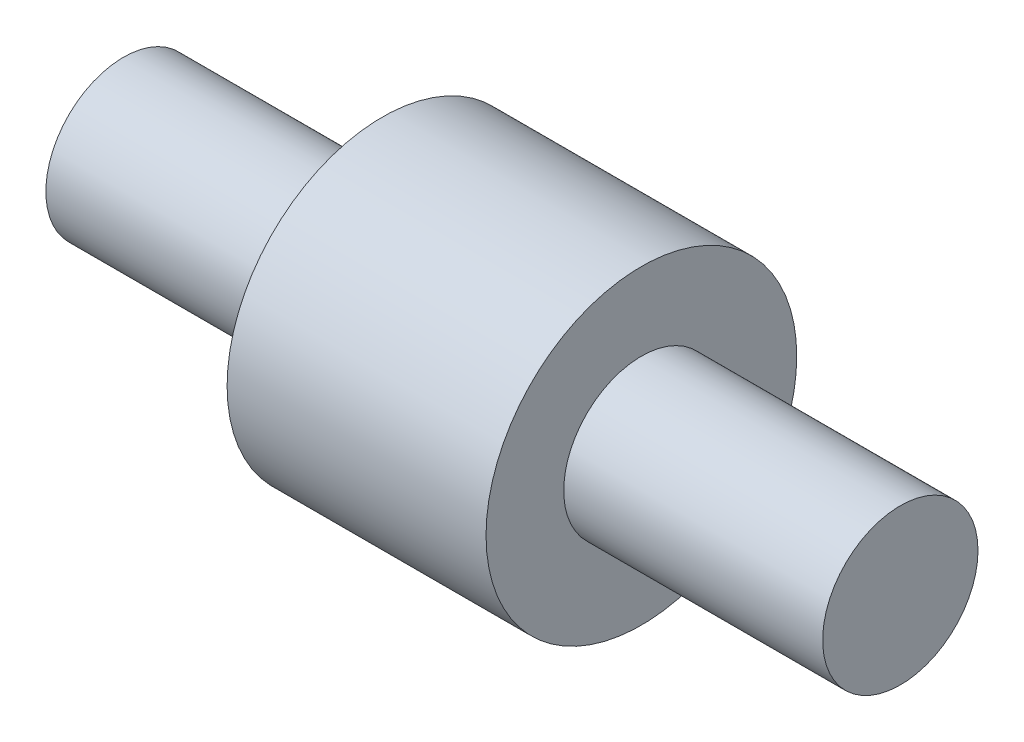
ISO-10303-21;
HEADER;
FILE_DESCRIPTION(('STEP AP214'),'2;1');
FILE_NAME('part.step','',(''),(''),'','','');
FILE_SCHEMA(('AUTOMOTIVE_DESIGN { 1 0 10303 214 1 1 1 1 }'));
ENDSEC;
DATA;
#1=APPLICATION_CONTEXT('core data for automotive mechanical design processes');
#2=APPLICATION_PROTOCOL_DEFINITION('international standard','automotive_design',2000,#1);
#3=PRODUCT_CONTEXT('',#1,'mechanical');
#4=PRODUCT('Part','Part','',(#3));
#5=PRODUCT_RELATED_PRODUCT_CATEGORY('part','',(#4));
#6=PRODUCT_DEFINITION_FORMATION('','',#4);
#7=PRODUCT_DEFINITION_CONTEXT('part definition',#1,'design');
#8=PRODUCT_DEFINITION('design','',#6,#7);
#9=PRODUCT_DEFINITION_SHAPE('','',#8);
#10=(LENGTH_UNIT() NAMED_UNIT(*) SI_UNIT(.MILLI.,.METRE.));
#11=(NAMED_UNIT(*) PLANE_ANGLE_UNIT() SI_UNIT($,.RADIAN.));
#12=(NAMED_UNIT(*) SI_UNIT($,.STERADIAN.) SOLID_ANGLE_UNIT());
#13=UNCERTAINTY_MEASURE_WITH_UNIT(LENGTH_MEASURE(1.E-05),#10,'distance_accuracy_value','');
#14=(GEOMETRIC_REPRESENTATION_CONTEXT(3) GLOBAL_UNCERTAINTY_ASSIGNED_CONTEXT((#13)) GLOBAL_UNIT_ASSIGNED_CONTEXT((#10,
#11,#12)) REPRESENTATION_CONTEXT('',''));
#15=CARTESIAN_POINT('',(0.,0.,0.));
#16=DIRECTION('',(0.,0.,1.));
#17=DIRECTION('',(1.,0.,0.));
#18=AXIS2_PLACEMENT_3D('',#15,#16,#17);
#19=CARTESIAN_POINT('',(0.,0.,0.));
#20=DIRECTION('',(-1.,0.,0.));
#21=DIRECTION('',(0.,0.,1.));
#22=AXIS2_PLACEMENT_3D('',#19,#20,#21);
#23=PLANE('',#22);
#24=CARTESIAN_POINT('',(0.,0.,0.));
#25=DIRECTION('',(1.,0.,0.));
#26=DIRECTION('',(0.,0.,-1.));
#27=AXIS2_PLACEMENT_3D('',#24,#25,#26);
#28=CIRCLE('',#27,1.5);
#29=CARTESIAN_POINT('',(0.,0.,-1.5));
#30=VERTEX_POINT('',#29);
#31=EDGE_CURVE('E10',#30,#30,#28,.T.);
#32=ORIENTED_EDGE('',*,*,#31,.F.);
#33=EDGE_LOOP('',(#32));
#34=FACE_BOUND('',#33,.T.);
#35=ADVANCED_FACE('F32',(#34),#23,.T.);
#36=CARTESIAN_POINT('',(15.,0.,0.));
#37=DIRECTION('',(1.,0.,0.));
#38=DIRECTION('',(0.,0.,-1.));
#39=AXIS2_PLACEMENT_3D('',#36,#37,#38);
#40=CYLINDRICAL_SURFACE('',#39,1.5);
#41=ORIENTED_EDGE('',*,*,#31,.T.);
#42=EDGE_LOOP('',(#41));
#43=FACE_BOUND('',#42,.T.);
#44=CARTESIAN_POINT('',(5.,0.,0.));
#45=DIRECTION('',(1.,0.,0.));
#46=DIRECTION('',(0.,0.,-1.));
#47=AXIS2_PLACEMENT_3D('',#44,#45,#46);
#48=CIRCLE('',#47,1.5);
#49=CARTESIAN_POINT('',(5.,0.,-1.5));
#50=VERTEX_POINT('',#49);
#51=EDGE_CURVE('E38',#50,#50,#48,.T.);
#52=ORIENTED_EDGE('',*,*,#51,.F.);
#53=EDGE_LOOP('',(#52));
#54=FACE_BOUND('',#53,.T.);
#55=ADVANCED_FACE('F74',(#43,#54),#40,.T.);
#56=CARTESIAN_POINT('',(5.,1.5,0.));
#57=DIRECTION('',(-1.,0.,0.));
#58=DIRECTION('',(0.,0.,1.));
#59=AXIS2_PLACEMENT_3D('',#56,#57,#58);
#60=PLANE('',#59);
#61=ORIENTED_EDGE('',*,*,#51,.T.);
#62=EDGE_LOOP('',(#61));
#63=FACE_BOUND('',#62,.T.);
#64=CARTESIAN_POINT('',(5.,0.,0.));
#65=DIRECTION('',(1.,0.,0.));
#66=DIRECTION('',(0.,0.,-1.));
#67=AXIS2_PLACEMENT_3D('',#64,#65,#66);
#68=CIRCLE('',#67,3.);
#69=CARTESIAN_POINT('',(5.,0.,-3.));
#70=VERTEX_POINT('',#69);
#71=EDGE_CURVE('E42',#70,#70,#68,.T.);
#72=ORIENTED_EDGE('',*,*,#71,.F.);
#73=EDGE_LOOP('',(#72));
#74=FACE_BOUND('',#73,.T.);
#75=ADVANCED_FACE('F79',(#63,#74),#60,.T.);
#76=CARTESIAN_POINT('',(15.,0.,0.));
#77=DIRECTION('',(1.,0.,0.));
#78=DIRECTION('',(0.,0.,-1.));
#79=AXIS2_PLACEMENT_3D('',#76,#77,#78);
#80=CYLINDRICAL_SURFACE('',#79,3.);
#81=ORIENTED_EDGE('',*,*,#71,.T.);
#82=EDGE_LOOP('',(#81));
#83=FACE_BOUND('',#82,.T.);
#84=CARTESIAN_POINT('',(10.,0.,0.));
#85=DIRECTION('',(1.,0.,0.));
#86=DIRECTION('',(0.,0.,-1.));
#87=AXIS2_PLACEMENT_3D('',#84,#85,#86);
#88=CIRCLE('',#87,3.);
#89=CARTESIAN_POINT('',(10.,0.,-3.));
#90=VERTEX_POINT('',#89);
#91=EDGE_CURVE('E46',#90,#90,#88,.T.);
#92=ORIENTED_EDGE('',*,*,#91,.F.);
#93=EDGE_LOOP('',(#92));
#94=FACE_BOUND('',#93,.T.);
#95=ADVANCED_FACE('F70',(#83,#94),#80,.T.);
#96=CARTESIAN_POINT('',(10.,3.,0.));
#97=DIRECTION('',(1.,0.,0.));
#98=DIRECTION('',(0.,0.,-1.));
#99=AXIS2_PLACEMENT_3D('',#96,#97,#98);
#100=PLANE('',#99);
#101=ORIENTED_EDGE('',*,*,#91,.T.);
#102=EDGE_LOOP('',(#101));
#103=FACE_BOUND('',#102,.T.);
#104=CARTESIAN_POINT('',(10.,0.,0.));
#105=DIRECTION('',(1.,0.,0.));
#106=DIRECTION('',(0.,0.,-1.));
#107=AXIS2_PLACEMENT_3D('',#104,#105,#106);
#108=CIRCLE('',#107,1.5);
#109=CARTESIAN_POINT('',(10.,0.,-1.5));
#110=VERTEX_POINT('',#109);
#111=EDGE_CURVE('E51',#110,#110,#108,.T.);
#112=ORIENTED_EDGE('',*,*,#111,.F.);
#113=EDGE_LOOP('',(#112));
#114=FACE_BOUND('',#113,.T.);
#115=ADVANCED_FACE('F62',(#103,#114),#100,.T.);
#116=CARTESIAN_POINT('',(15.,0.,0.));
#117=DIRECTION('',(1.,0.,0.));
#118=DIRECTION('',(0.,0.,-1.));
#119=AXIS2_PLACEMENT_3D('',#116,#117,#118);
#120=CYLINDRICAL_SURFACE('',#119,1.5);
#121=ORIENTED_EDGE('',*,*,#111,.T.);
#122=EDGE_LOOP('',(#121));
#123=FACE_BOUND('',#122,.T.);
#124=CARTESIAN_POINT('',(15.,0.,0.));
#125=DIRECTION('',(1.,0.,0.));
#126=DIRECTION('',(0.,0.,-1.));
#127=AXIS2_PLACEMENT_3D('',#124,#125,#126);
#128=CIRCLE('',#127,1.5);
#129=CARTESIAN_POINT('',(15.,0.,-1.5));
#130=VERTEX_POINT('',#129);
#131=EDGE_CURVE('E54',#130,#130,#128,.T.);
#132=ORIENTED_EDGE('',*,*,#131,.F.);
#133=EDGE_LOOP('',(#132));
#134=FACE_BOUND('',#133,.T.);
#135=ADVANCED_FACE('F60',(#123,#134),#120,.T.);
#136=CARTESIAN_POINT('',(15.,1.5,0.));
#137=DIRECTION('',(1.,0.,0.));
#138=DIRECTION('',(0.,0.,-1.));
#139=AXIS2_PLACEMENT_3D('',#136,#137,#138);
#140=PLANE('',#139);
#141=ORIENTED_EDGE('',*,*,#131,.T.);
#142=EDGE_LOOP('',(#141));
#143=FACE_BOUND('',#142,.T.);
#144=ADVANCED_FACE('F58',(#143),#140,.T.);
#145=CLOSED_SHELL('',(#35,#55,#75,#95,#115,#135,#144));
#146=MANIFOLD_SOLID_BREP('B2',#145);
#147=ADVANCED_BREP_SHAPE_REPRESENTATION('',(#18,#146),#14);
#148=SHAPE_DEFINITION_REPRESENTATION(#9,#147);
ENDSEC;
END-ISO-10303-21;
